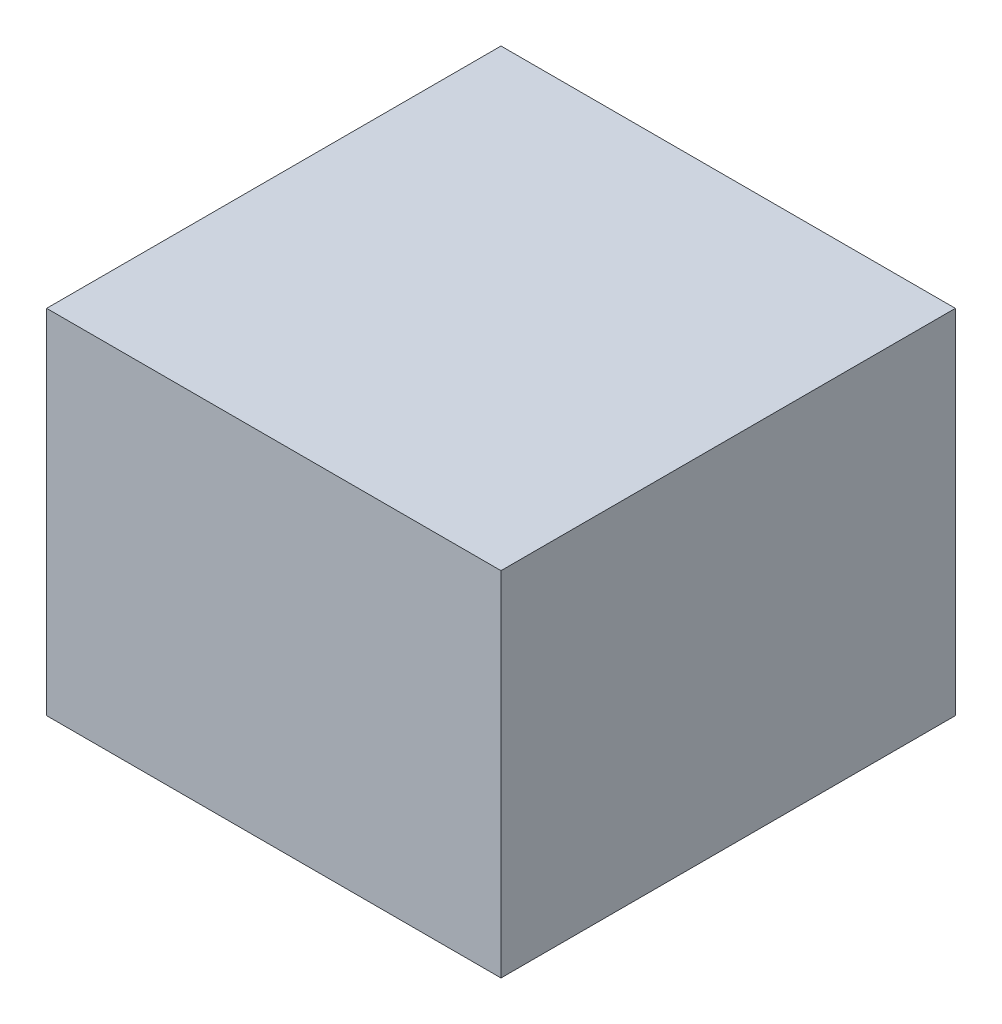
ISO-10303-21;
HEADER;
FILE_DESCRIPTION(('STEP AP214'),'2;1');
FILE_NAME('part.step','',(''),(''),'','','');
FILE_SCHEMA(('AUTOMOTIVE_DESIGN { 1 0 10303 214 1 1 1 1 }'));
ENDSEC;
DATA;
#1=APPLICATION_CONTEXT('core data for automotive mechanical design processes');
#2=APPLICATION_PROTOCOL_DEFINITION('international standard','automotive_design',2000,#1);
#3=PRODUCT_CONTEXT('',#1,'mechanical');
#4=PRODUCT('Part','Part','',(#3));
#5=PRODUCT_RELATED_PRODUCT_CATEGORY('part','',(#4));
#6=PRODUCT_DEFINITION_FORMATION('','',#4);
#7=PRODUCT_DEFINITION_CONTEXT('part definition',#1,'design');
#8=PRODUCT_DEFINITION('design','',#6,#7);
#9=PRODUCT_DEFINITION_SHAPE('','',#8);
#10=(LENGTH_UNIT() NAMED_UNIT(*) SI_UNIT(.MILLI.,.METRE.));
#11=(NAMED_UNIT(*) PLANE_ANGLE_UNIT() SI_UNIT($,.RADIAN.));
#12=(NAMED_UNIT(*) SI_UNIT($,.STERADIAN.) SOLID_ANGLE_UNIT());
#13=UNCERTAINTY_MEASURE_WITH_UNIT(LENGTH_MEASURE(1.E-05),#10,'distance_accuracy_value','');
#14=(GEOMETRIC_REPRESENTATION_CONTEXT(3) GLOBAL_UNCERTAINTY_ASSIGNED_CONTEXT((#13)) GLOBAL_UNIT_ASSIGNED_CONTEXT((#10,
#11,#12)) REPRESENTATION_CONTEXT('',''));
#15=CARTESIAN_POINT('',(0.,0.,0.));
#16=DIRECTION('',(0.,0.,1.));
#17=DIRECTION('',(1.,0.,0.));
#18=AXIS2_PLACEMENT_3D('',#15,#16,#17);
#19=CARTESIAN_POINT('',(16.1,25.,-16.1));
#20=DIRECTION('',(-1.,0.,0.));
#21=DIRECTION('',(0.,0.,1.));
#22=AXIS2_PLACEMENT_3D('',#19,#20,#21);
#23=PLANE('',#22);
#24=DIRECTION('',(0.,0.,-1.));
#25=VECTOR('',#24,1.);
#26=CARTESIAN_POINT('',(16.1,0.,-16.1));
#27=LINE('',#26,#25);
#28=CARTESIAN_POINT('',(16.1,0.,16.1));
#29=VERTEX_POINT('',#28);
#30=CARTESIAN_POINT('',(16.1,0.,-16.1));
#31=VERTEX_POINT('',#30);
#32=EDGE_CURVE('E96',#29,#31,#27,.T.);
#33=ORIENTED_EDGE('',*,*,#32,.T.);
#34=DIRECTION('',(0.,-1.,0.));
#35=VECTOR('',#34,1.);
#36=CARTESIAN_POINT('',(16.1,25.,-16.1));
#37=LINE('',#36,#35);
#38=CARTESIAN_POINT('',(16.1,25.,-16.1));
#39=VERTEX_POINT('',#38);
#40=EDGE_CURVE('E11',#39,#31,#37,.T.);
#41=ORIENTED_EDGE('',*,*,#40,.F.);
#42=DIRECTION('',(0.,0.,-1.));
#43=VECTOR('',#42,1.);
#44=CARTESIAN_POINT('',(16.1,25.,-16.1));
#45=LINE('',#44,#43);
#46=CARTESIAN_POINT('',(16.1,25.,16.1));
#47=VERTEX_POINT('',#46);
#48=EDGE_CURVE('E84',#47,#39,#45,.T.);
#49=ORIENTED_EDGE('',*,*,#48,.F.);
#50=DIRECTION('',(0.,-1.,0.));
#51=VECTOR('',#50,1.);
#52=CARTESIAN_POINT('',(16.1,25.,16.1));
#53=LINE('',#52,#51);
#54=EDGE_CURVE('E92',#47,#29,#53,.T.);
#55=ORIENTED_EDGE('',*,*,#54,.T.);
#56=EDGE_LOOP('',(#33,#41,#49,#55));
#57=FACE_BOUND('',#56,.T.);
#58=ADVANCED_FACE('F33',(#57),#23,.F.);
#59=CARTESIAN_POINT('',(-16.1,25.,-16.1));
#60=DIRECTION('',(0.,0.,1.));
#61=DIRECTION('',(1.,0.,0.));
#62=AXIS2_PLACEMENT_3D('',#59,#60,#61);
#63=PLANE('',#62);
#64=DIRECTION('',(-1.,0.,0.));
#65=VECTOR('',#64,1.);
#66=CARTESIAN_POINT('',(-16.1,0.,-16.1));
#67=LINE('',#66,#65);
#68=CARTESIAN_POINT('',(-16.1,0.,-16.1));
#69=VERTEX_POINT('',#68);
#70=EDGE_CURVE('E88',#31,#69,#67,.T.);
#71=ORIENTED_EDGE('',*,*,#70,.T.);
#72=DIRECTION('',(0.,-1.,0.));
#73=VECTOR('',#72,1.);
#74=CARTESIAN_POINT('',(-16.1,25.,-16.1));
#75=LINE('',#74,#73);
#76=CARTESIAN_POINT('',(-16.1,25.,-16.1));
#77=VERTEX_POINT('',#76);
#78=EDGE_CURVE('E41',#77,#69,#75,.T.);
#79=ORIENTED_EDGE('',*,*,#78,.F.);
#80=DIRECTION('',(-1.,0.,0.));
#81=VECTOR('',#80,1.);
#82=CARTESIAN_POINT('',(-16.1,25.,-16.1));
#83=LINE('',#82,#81);
#84=EDGE_CURVE('E79',#39,#77,#83,.T.);
#85=ORIENTED_EDGE('',*,*,#84,.F.);
#86=ORIENTED_EDGE('',*,*,#40,.T.);
#87=EDGE_LOOP('',(#71,#79,#85,#86));
#88=FACE_BOUND('',#87,.T.);
#89=ADVANCED_FACE('F87',(#88),#63,.F.);
#90=CARTESIAN_POINT('',(-16.1,25.,-16.1));
#91=DIRECTION('',(1.,0.,0.));
#92=DIRECTION('',(0.,0.,-1.));
#93=AXIS2_PLACEMENT_3D('',#90,#91,#92);
#94=PLANE('',#93);
#95=DIRECTION('',(0.,0.,1.));
#96=VECTOR('',#95,1.);
#97=CARTESIAN_POINT('',(-16.1,0.,-16.1));
#98=LINE('',#97,#96);
#99=CARTESIAN_POINT('',(-16.1,0.,16.1));
#100=VERTEX_POINT('',#99);
#101=EDGE_CURVE('E66',#69,#100,#98,.T.);
#102=ORIENTED_EDGE('',*,*,#101,.T.);
#103=DIRECTION('',(0.,-1.,0.));
#104=VECTOR('',#103,1.);
#105=CARTESIAN_POINT('',(-16.1,25.,16.1));
#106=LINE('',#105,#104);
#107=CARTESIAN_POINT('',(-16.1,25.,16.1));
#108=VERTEX_POINT('',#107);
#109=EDGE_CURVE('E89',#108,#100,#106,.T.);
#110=ORIENTED_EDGE('',*,*,#109,.F.);
#111=DIRECTION('',(0.,0.,1.));
#112=VECTOR('',#111,1.);
#113=CARTESIAN_POINT('',(-16.1,25.,-16.1));
#114=LINE('',#113,#112);
#115=EDGE_CURVE('E82',#77,#108,#114,.T.);
#116=ORIENTED_EDGE('',*,*,#115,.F.);
#117=ORIENTED_EDGE('',*,*,#78,.T.);
#118=EDGE_LOOP('',(#102,#110,#116,#117));
#119=FACE_BOUND('',#118,.T.);
#120=ADVANCED_FACE('F90',(#119),#94,.F.);
#121=CARTESIAN_POINT('',(-16.1,25.,16.1));
#122=DIRECTION('',(0.,0.,-1.));
#123=DIRECTION('',(-1.,0.,0.));
#124=AXIS2_PLACEMENT_3D('',#121,#122,#123);
#125=PLANE('',#124);
#126=DIRECTION('',(1.,0.,0.));
#127=VECTOR('',#126,1.);
#128=CARTESIAN_POINT('',(-16.1,0.,16.1));
#129=LINE('',#128,#127);
#130=EDGE_CURVE('E72',#100,#29,#129,.T.);
#131=ORIENTED_EDGE('',*,*,#130,.T.);
#132=ORIENTED_EDGE('',*,*,#54,.F.);
#133=DIRECTION('',(1.,0.,0.));
#134=VECTOR('',#133,1.);
#135=CARTESIAN_POINT('',(-16.1,25.,16.1));
#136=LINE('',#135,#134);
#137=EDGE_CURVE('E49',#108,#47,#136,.T.);
#138=ORIENTED_EDGE('',*,*,#137,.F.);
#139=ORIENTED_EDGE('',*,*,#109,.T.);
#140=EDGE_LOOP('',(#131,#132,#138,#139));
#141=FACE_BOUND('',#140,.T.);
#142=ADVANCED_FACE('F103',(#141),#125,.F.);
#143=CARTESIAN_POINT('',(0.,25.,0.));
#144=DIRECTION('',(0.,1.,0.));
#145=DIRECTION('',(0.,0.,1.));
#146=AXIS2_PLACEMENT_3D('',#143,#144,#145);
#147=PLANE('',#146);
#148=ORIENTED_EDGE('',*,*,#48,.T.);
#149=ORIENTED_EDGE('',*,*,#84,.T.);
#150=ORIENTED_EDGE('',*,*,#115,.T.);
#151=ORIENTED_EDGE('',*,*,#137,.T.);
#152=EDGE_LOOP('',(#148,#149,#150,#151));
#153=FACE_BOUND('',#152,.T.);
#154=ADVANCED_FACE('F80',(#153),#147,.T.);
#155=CARTESIAN_POINT('',(0.,0.,0.));
#156=DIRECTION('',(0.,1.,0.));
#157=DIRECTION('',(0.,0.,1.));
#158=AXIS2_PLACEMENT_3D('',#155,#156,#157);
#159=PLANE('',#158);
#160=ORIENTED_EDGE('',*,*,#32,.F.);
#161=ORIENTED_EDGE('',*,*,#130,.F.);
#162=ORIENTED_EDGE('',*,*,#101,.F.);
#163=ORIENTED_EDGE('',*,*,#70,.F.);
#164=EDGE_LOOP('',(#160,#161,#162,#163));
#165=FACE_BOUND('',#164,.T.);
#166=ADVANCED_FACE('F106',(#165),#159,.F.);
#167=CLOSED_SHELL('',(#58,#89,#120,#142,#154,#166));
#168=MANIFOLD_SOLID_BREP('B2',#167);
#169=ADVANCED_BREP_SHAPE_REPRESENTATION('',(#18,#168),#14);
#170=SHAPE_DEFINITION_REPRESENTATION(#9,#169);
ENDSEC;
END-ISO-10303-21;
